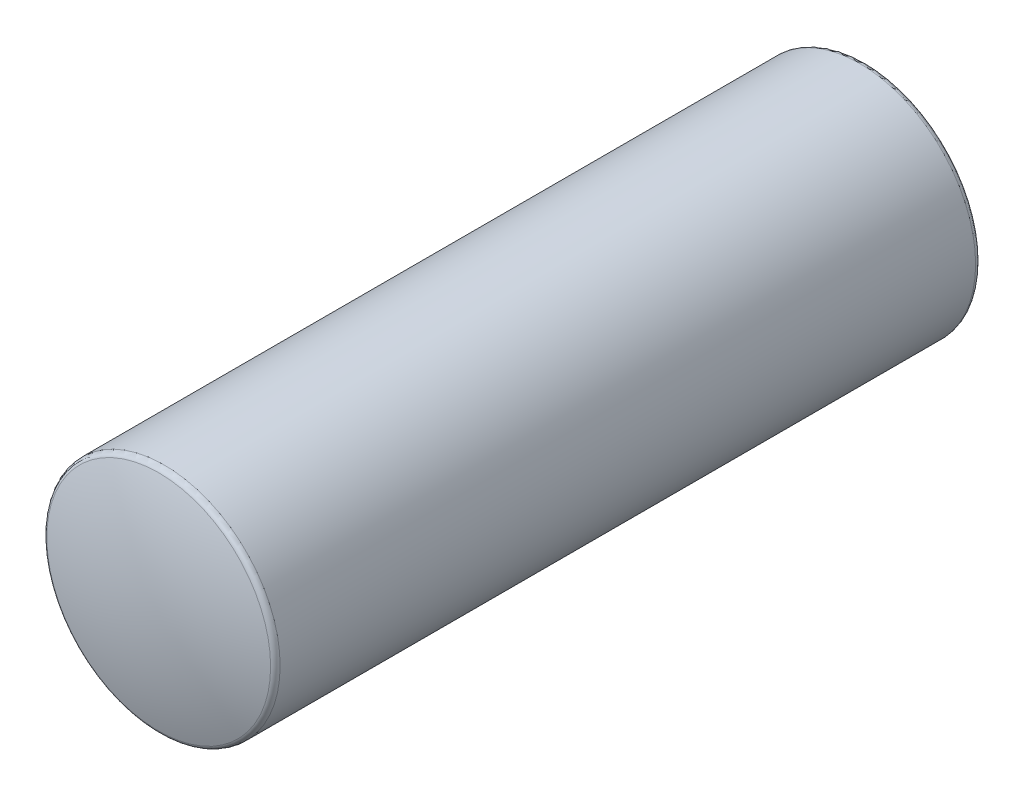
ISO-10303-21;
HEADER;
FILE_DESCRIPTION(('STEP AP214'),'2;1');
FILE_NAME('part.step','',(''),(''),'','','');
FILE_SCHEMA(('AUTOMOTIVE_DESIGN { 1 0 10303 214 1 1 1 1 }'));
ENDSEC;
DATA;
#1=APPLICATION_CONTEXT('core data for automotive mechanical design processes');
#2=APPLICATION_PROTOCOL_DEFINITION('international standard','automotive_design',2000,#1);
#3=PRODUCT_CONTEXT('',#1,'mechanical');
#4=PRODUCT('Part','Part','',(#3));
#5=PRODUCT_RELATED_PRODUCT_CATEGORY('part','',(#4));
#6=PRODUCT_DEFINITION_FORMATION('','',#4);
#7=PRODUCT_DEFINITION_CONTEXT('part definition',#1,'design');
#8=PRODUCT_DEFINITION('design','',#6,#7);
#9=PRODUCT_DEFINITION_SHAPE('','',#8);
#10=(LENGTH_UNIT() NAMED_UNIT(*) SI_UNIT(.MILLI.,.METRE.));
#11=(NAMED_UNIT(*) PLANE_ANGLE_UNIT() SI_UNIT($,.RADIAN.));
#12=(NAMED_UNIT(*) SI_UNIT($,.STERADIAN.) SOLID_ANGLE_UNIT());
#13=UNCERTAINTY_MEASURE_WITH_UNIT(LENGTH_MEASURE(1.E-05),#10,'distance_accuracy_value','');
#14=(GEOMETRIC_REPRESENTATION_CONTEXT(3) GLOBAL_UNCERTAINTY_ASSIGNED_CONTEXT((#13)) GLOBAL_UNIT_ASSIGNED_CONTEXT((#10,
#11,#12)) REPRESENTATION_CONTEXT('',''));
#15=CARTESIAN_POINT('',(0.,0.,0.));
#16=DIRECTION('',(0.,0.,1.));
#17=DIRECTION('',(1.,0.,0.));
#18=AXIS2_PLACEMENT_3D('',#15,#16,#17);
#19=CARTESIAN_POINT('',(0.,0.,-3066.66666666667));
#20=DIRECTION('',(0.,0.,1.));
#21=DIRECTION('',(0.,1.,0.));
#22=AXIS2_PLACEMENT_3D('',#19,#20,#21);
#23=SPHERICAL_SURFACE('',#22,3133.33333333333);
#24=CARTESIAN_POINT('',(0.,0.,-6047.56756756757));
#25=DIRECTION('',(0.,0.,1.));
#26=DIRECTION('',(1.,0.,0.));
#27=AXIS2_PLACEMENT_3D('',#24,#25,#26);
#28=CIRCLE('',#27,965.405405405405);
#29=CARTESIAN_POINT('',(965.405405405405,0.,-6047.56756756757));
#30=VERTEX_POINT('',#29);
#31=EDGE_CURVE('E10',#30,#30,#28,.T.);
#32=ORIENTED_EDGE('',*,*,#31,.F.);
#33=EDGE_LOOP('',(#32));
#34=FACE_BOUND('',#33,.T.);
#35=ADVANCED_FACE('F38',(#34),#23,.T.);
#36=CARTESIAN_POINT('',(0.,0.,-6000.));
#37=DIRECTION('',(0.,0.,1.));
#38=DIRECTION('',(1.,0.,0.));
#39=AXIS2_PLACEMENT_3D('',#36,#37,#38);
#40=TOROIDAL_SURFACE('',#39,950.,50.0000000000003);
#41=ORIENTED_EDGE('',*,*,#31,.T.);
#42=EDGE_LOOP('',(#41));
#43=FACE_BOUND('',#42,.T.);
#44=CARTESIAN_POINT('',(0.,0.,-6000.));
#45=DIRECTION('',(0.,0.,1.));
#46=DIRECTION('',(1.,0.,0.));
#47=AXIS2_PLACEMENT_3D('',#44,#45,#46);
#48=CIRCLE('',#47,1000.);
#49=CARTESIAN_POINT('',(1000.,0.,-6000.));
#50=VERTEX_POINT('',#49);
#51=EDGE_CURVE('E46',#50,#50,#48,.T.);
#52=ORIENTED_EDGE('',*,*,#51,.F.);
#53=EDGE_LOOP('',(#52));
#54=FACE_BOUND('',#53,.T.);
#55=ADVANCED_FACE('F110',(#43,#54),#40,.T.);
#56=CARTESIAN_POINT('',(0.,0.,0.));
#57=DIRECTION('',(0.,0.,1.));
#58=DIRECTION('',(1.,0.,0.));
#59=AXIS2_PLACEMENT_3D('',#56,#57,#58);
#60=CYLINDRICAL_SURFACE('',#59,1000.);
#61=ORIENTED_EDGE('',*,*,#51,.T.);
#62=EDGE_LOOP('',(#61));
#63=FACE_BOUND('',#62,.T.);
#64=CARTESIAN_POINT('',(0.,0.,0.));
#65=DIRECTION('',(0.,0.,1.));
#66=DIRECTION('',(1.,0.,0.));
#67=AXIS2_PLACEMENT_3D('',#64,#65,#66);
#68=CIRCLE('',#67,1000.);
#69=CARTESIAN_POINT('',(1000.,0.,0.));
#70=VERTEX_POINT('',#69);
#71=EDGE_CURVE('E50',#70,#70,#68,.T.);
#72=ORIENTED_EDGE('',*,*,#71,.F.);
#73=EDGE_LOOP('',(#72));
#74=FACE_BOUND('',#73,.T.);
#75=ADVANCED_FACE('F106',(#63,#74),#60,.T.);
#76=CARTESIAN_POINT('',(0.,0.,0.));
#77=DIRECTION('',(0.,0.,1.));
#78=DIRECTION('',(1.,0.,0.));
#79=AXIS2_PLACEMENT_3D('',#76,#77,#78);
#80=TOROIDAL_SURFACE('',#79,950.,50.0000000000002);
#81=ORIENTED_EDGE('',*,*,#71,.T.);
#82=EDGE_LOOP('',(#81));
#83=FACE_BOUND('',#82,.T.);
#84=CARTESIAN_POINT('',(0.,0.,47.5675675675675));
#85=DIRECTION('',(0.,0.,1.));
#86=DIRECTION('',(1.,0.,0.));
#87=AXIS2_PLACEMENT_3D('',#84,#85,#86);
#88=CIRCLE('',#87,965.405405405406);
#89=CARTESIAN_POINT('',(965.405405405406,0.,47.5675675675675));
#90=VERTEX_POINT('',#89);
#91=EDGE_CURVE('E54',#90,#90,#88,.T.);
#92=ORIENTED_EDGE('',*,*,#91,.F.);
#93=EDGE_LOOP('',(#92));
#94=FACE_BOUND('',#93,.T.);
#95=ADVANCED_FACE('F102',(#83,#94),#80,.T.);
#96=CARTESIAN_POINT('',(0.,0.,-2933.33333333333));
#97=DIRECTION('',(0.,0.,1.));
#98=DIRECTION('',(0.,1.,0.));
#99=AXIS2_PLACEMENT_3D('',#96,#97,#98);
#100=SPHERICAL_SURFACE('',#99,3133.33333333333);
#101=ORIENTED_EDGE('',*,*,#91,.T.);
#102=EDGE_LOOP('',(#101));
#103=FACE_BOUND('',#102,.T.);
#104=ADVANCED_FACE('F99',(#103),#100,.T.);
#105=CLOSED_SHELL('',(#35,#55,#75,#95,#104));
#106=CARTESIAN_POINT('',(0.,0.,-3066.66666666667));
#107=DIRECTION('',(0.,0.,1.));
#108=DIRECTION('',(0.,1.,0.));
#109=AXIS2_PLACEMENT_3D('',#106,#107,#108);
#110=SPHERICAL_SURFACE('',#109,3128.33333333333);
#111=CARTESIAN_POINT('',(0.,0.,-6042.81081081081));
#112=DIRECTION('',(0.,0.,1.));
#113=DIRECTION('',(1.,0.,0.));
#114=AXIS2_PLACEMENT_3D('',#111,#112,#113);
#115=CIRCLE('',#114,963.864864864865);
#116=CARTESIAN_POINT('',(963.864864864865,0.,-6042.81081081081));
#117=VERTEX_POINT('',#116);
#118=EDGE_CURVE('E68',#117,#117,#115,.T.);
#119=ORIENTED_EDGE('',*,*,#118,.T.);
#120=EDGE_LOOP('',(#119));
#121=FACE_BOUND('',#120,.T.);
#122=ADVANCED_FACE('F40',(#121),#110,.F.);
#123=CARTESIAN_POINT('',(0.,0.,-2933.33333333333));
#124=DIRECTION('',(0.,0.,1.));
#125=DIRECTION('',(0.,1.,0.));
#126=AXIS2_PLACEMENT_3D('',#123,#124,#125);
#127=SPHERICAL_SURFACE('',#126,3128.33333333333);
#128=CARTESIAN_POINT('',(0.,0.,42.8108108108108));
#129=DIRECTION('',(0.,0.,1.));
#130=DIRECTION('',(1.,0.,0.));
#131=AXIS2_PLACEMENT_3D('',#128,#129,#130);
#132=CIRCLE('',#131,963.864864864866);
#133=CARTESIAN_POINT('',(963.864864864866,0.,42.8108108108108));
#134=VERTEX_POINT('',#133);
#135=EDGE_CURVE('E59',#134,#134,#132,.T.);
#136=ORIENTED_EDGE('',*,*,#135,.F.);
#137=EDGE_LOOP('',(#136));
#138=FACE_BOUND('',#137,.T.);
#139=ADVANCED_FACE('F89',(#138),#127,.F.);
#140=CARTESIAN_POINT('',(0.,0.,0.));
#141=DIRECTION('',(0.,0.,1.));
#142=DIRECTION('',(1.,0.,0.));
#143=AXIS2_PLACEMENT_3D('',#140,#141,#142);
#144=TOROIDAL_SURFACE('',#143,950.,45.0000000000002);
#145=CARTESIAN_POINT('',(0.,0.,0.));
#146=DIRECTION('',(0.,0.,1.));
#147=DIRECTION('',(1.,0.,0.));
#148=AXIS2_PLACEMENT_3D('',#145,#146,#147);
#149=CIRCLE('',#148,995.);
#150=CARTESIAN_POINT('',(995.,0.,0.));
#151=VERTEX_POINT('',#150);
#152=EDGE_CURVE('E62',#151,#151,#149,.T.);
#153=ORIENTED_EDGE('',*,*,#152,.F.);
#154=EDGE_LOOP('',(#153));
#155=FACE_BOUND('',#154,.T.);
#156=ORIENTED_EDGE('',*,*,#135,.T.);
#157=EDGE_LOOP('',(#156));
#158=FACE_BOUND('',#157,.T.);
#159=ADVANCED_FACE('F83',(#155,#158),#144,.F.);
#160=CARTESIAN_POINT('',(0.,0.,0.));
#161=DIRECTION('',(0.,0.,1.));
#162=DIRECTION('',(1.,0.,0.));
#163=AXIS2_PLACEMENT_3D('',#160,#161,#162);
#164=CYLINDRICAL_SURFACE('',#163,995.);
#165=CARTESIAN_POINT('',(0.,0.,-6000.));
#166=DIRECTION('',(0.,0.,1.));
#167=DIRECTION('',(1.,0.,0.));
#168=AXIS2_PLACEMENT_3D('',#165,#166,#167);
#169=CIRCLE('',#168,995.);
#170=CARTESIAN_POINT('',(995.,0.,-6000.));
#171=VERTEX_POINT('',#170);
#172=EDGE_CURVE('E65',#171,#171,#169,.T.);
#173=ORIENTED_EDGE('',*,*,#172,.F.);
#174=EDGE_LOOP('',(#173));
#175=FACE_BOUND('',#174,.T.);
#176=ORIENTED_EDGE('',*,*,#152,.T.);
#177=EDGE_LOOP('',(#176));
#178=FACE_BOUND('',#177,.T.);
#179=ADVANCED_FACE('F76',(#175,#178),#164,.F.);
#180=CARTESIAN_POINT('',(0.,0.,-6000.));
#181=DIRECTION('',(0.,0.,1.));
#182=DIRECTION('',(1.,0.,0.));
#183=AXIS2_PLACEMENT_3D('',#180,#181,#182);
#184=TOROIDAL_SURFACE('',#183,950.,45.0000000000003);
#185=ORIENTED_EDGE('',*,*,#118,.F.);
#186=EDGE_LOOP('',(#185));
#187=FACE_BOUND('',#186,.T.);
#188=ORIENTED_EDGE('',*,*,#172,.T.);
#189=EDGE_LOOP('',(#188));
#190=FACE_BOUND('',#189,.T.);
#191=ADVANCED_FACE('F73',(#187,#190),#184,.F.);
#192=CLOSED_SHELL('',(#122,#139,#159,#179,#191));
#193=ORIENTED_CLOSED_SHELL('',*,#192,.T.);
#194=BREP_WITH_VOIDS('B2',#105,(#193));
#195=ADVANCED_BREP_SHAPE_REPRESENTATION('',(#18,#194),#14);
#196=SHAPE_DEFINITION_REPRESENTATION(#9,#195);
ENDSEC;
END-ISO-10303-21;
